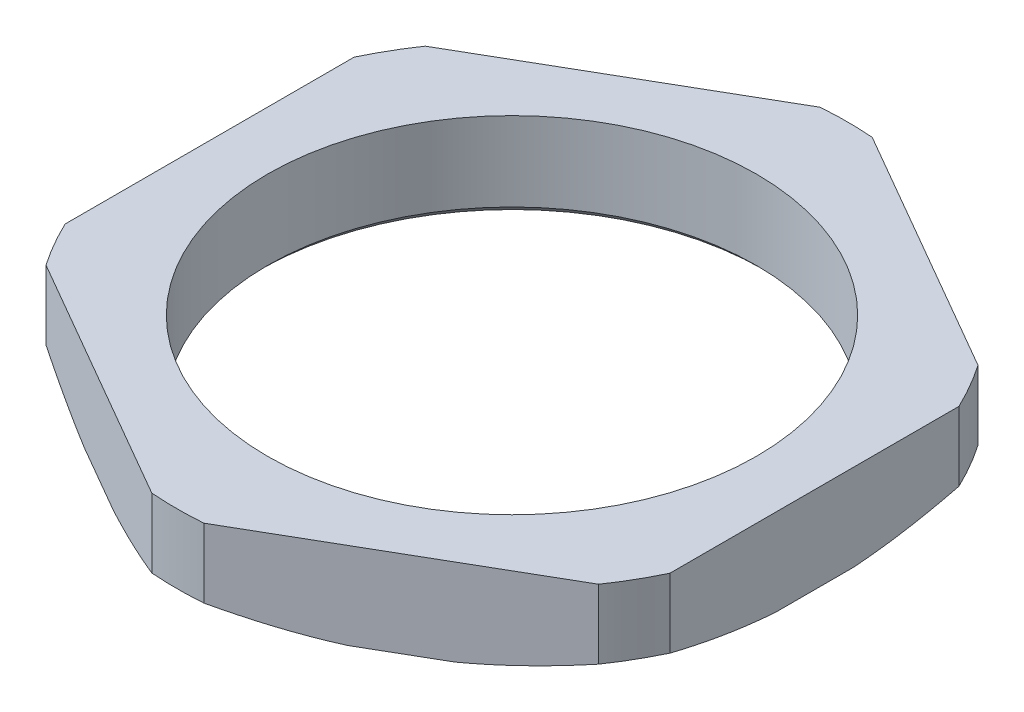
ISO-10303-21;
HEADER;
FILE_DESCRIPTION(('STEP AP214'),'2;1');
FILE_NAME('part.step','',(''),(''),'','','');
FILE_SCHEMA(('AUTOMOTIVE_DESIGN { 1 0 10303 214 1 1 1 1 }'));
ENDSEC;
DATA;
#1=APPLICATION_CONTEXT('core data for automotive mechanical design processes');
#2=APPLICATION_PROTOCOL_DEFINITION('international standard','automotive_design',2000,#1);
#3=PRODUCT_CONTEXT('',#1,'mechanical');
#4=PRODUCT('Part','Part','',(#3));
#5=PRODUCT_RELATED_PRODUCT_CATEGORY('part','',(#4));
#6=PRODUCT_DEFINITION_FORMATION('','',#4);
#7=PRODUCT_DEFINITION_CONTEXT('part definition',#1,'design');
#8=PRODUCT_DEFINITION('design','',#6,#7);
#9=PRODUCT_DEFINITION_SHAPE('','',#8);
#10=(LENGTH_UNIT() NAMED_UNIT(*) SI_UNIT(.MILLI.,.METRE.));
#11=(NAMED_UNIT(*) PLANE_ANGLE_UNIT() SI_UNIT($,.RADIAN.));
#12=(NAMED_UNIT(*) SI_UNIT($,.STERADIAN.) SOLID_ANGLE_UNIT());
#13=UNCERTAINTY_MEASURE_WITH_UNIT(LENGTH_MEASURE(1.E-05),#10,'distance_accuracy_value','');
#14=(GEOMETRIC_REPRESENTATION_CONTEXT(3) GLOBAL_UNCERTAINTY_ASSIGNED_CONTEXT((#13)) GLOBAL_UNIT_ASSIGNED_CONTEXT((#10,
#11,#12)) REPRESENTATION_CONTEXT('',''));
#15=CARTESIAN_POINT('',(0.,0.,0.));
#16=DIRECTION('',(0.,0.,1.));
#17=DIRECTION('',(1.,0.,0.));
#18=AXIS2_PLACEMENT_3D('',#15,#16,#17);
#19=CARTESIAN_POINT('',(0.,-27.1973321835051,0.));
#20=DIRECTION('',(0.,1.,0.));
#21=DIRECTION('',(0.,0.,1.));
#22=AXIS2_PLACEMENT_3D('',#19,#20,#21);
#23=CONICAL_SURFACE('',#22,50.,1.0471975511966);
#24=CARTESIAN_POINT('',(18.3610824149374,-38.6,-24.0402402765008));
#25=CARTESIAN_POINT('',(18.7382562288762,-38.5677652136786,-23.8224494033926));
#26=CARTESIAN_POINT('',(19.1150634151375,-38.5302174003489,-23.6048234457649));
#27=CARTESIAN_POINT('',(19.8688161578509,-38.4446695734121,-23.1695063900173));
#28=CARTESIAN_POINT('',(20.2457593680452,-38.396641759302,-22.9518166866672));
#29=CARTESIAN_POINT('',(21.001058094783,-38.2901413551853,-22.5157462243451));
#30=CARTESIAN_POINT('',(21.3794070228387,-38.2316033486737,-22.2973700743694));
#31=CARTESIAN_POINT('',(22.1386580231048,-38.1041345691691,-21.8591620056769));
#32=CARTESIAN_POINT('',(22.5195477934416,-38.0351057252138,-21.6393373659716));
#33=CARTESIAN_POINT('',(23.273149310614,-37.8889431103794,-21.2042687274169));
#34=CARTESIAN_POINT('',(23.6458862650549,-37.8119748480218,-20.9890126494644));
#35=CARTESIAN_POINT('',(24.3932664391002,-37.6486224093566,-20.5574335452286));
#36=CARTESIAN_POINT('',(24.7678970141932,-37.5621603823469,-20.34111812369));
#37=CARTESIAN_POINT('',(25.5199262760524,-37.3798473874207,-19.9069410339699));
#38=CARTESIAN_POINT('',(25.8973077347134,-37.2839004969652,-19.6890899081569));
#39=CARTESIAN_POINT('',(26.6556216700552,-37.0826361137301,-19.2513414411712));
#40=CARTESIAN_POINT('',(27.0365322822852,-36.9772085681087,-19.031456771969));
#41=CARTESIAN_POINT('',(27.4165967559554,-36.8679491924312,-18.8120366340634));
#42=B_SPLINE_CURVE_WITH_KNOTS('',3,(#24,#25,#26,#27,#28,#29,#30,#31,#32,#33,#34,#35,#36,#37,#38,
#39,#40,#41),.UNSPECIFIED.,.F.,.F.,(4,2,2,2,2,2,2,2,4),(0.,1.31014422115406,2.62380707882064,
3.94594918267663,5.28131229155487,6.59298565196993,7.91635666592117,9.2548364538421,
10.6115906910393),.UNSPECIFIED.);
#43=CARTESIAN_POINT('',(18.3610824149372,-38.6,-24.0402402765006));
#44=VERTEX_POINT('',#43);
#45=CARTESIAN_POINT('',(27.4165967559554,-36.8679491924312,-18.8120366340633));
#46=VERTEX_POINT('',#45);
#47=EDGE_CURVE('E548',#44,#46,#42,.T.);
#48=ORIENTED_EDGE('',*,*,#47,.T.);
#49=CARTESIAN_POINT('',(0.,-36.8679491924312,0.));
#50=DIRECTION('',(0.,-1.,0.));
#51=DIRECTION('',(0.,0.,1.));
#52=AXIS2_PLACEMENT_3D('',#49,#50,#51);
#53=CIRCLE('',#52,33.25);
#54=CARTESIAN_POINT('',(30.,-36.8679491924312,-14.3374509589397));
#55=VERTEX_POINT('',#54);
#56=EDGE_CURVE('E600',#46,#55,#53,.T.);
#57=ORIENTED_EDGE('',*,*,#56,.T.);
#58=CARTESIAN_POINT('',(30.0000000000002,-36.8679491924312,-14.3374509589397));
#59=CARTESIAN_POINT('',(29.9999914392657,-36.9763099923725,-13.9022042546082));
#60=CARTESIAN_POINT('',(29.9999632886276,-37.080901257903,-13.466008413138));
#61=CARTESIAN_POINT('',(29.9999105496554,-37.2806547432178,-12.5975925785544));
#62=CARTESIAN_POINT('',(29.9998859187907,-37.375924178509,-12.1653972226606));
#63=CARTESIAN_POINT('',(29.999880523527,-37.5570436549169,-11.3040883776325));
#64=CARTESIAN_POINT('',(29.9998992707064,-37.642987277463,-10.8749946177221));
#65=CARTESIAN_POINT('',(29.9999648804021,-37.8054636833068,-10.0189396742454));
#66=CARTESIAN_POINT('',(30.0000114939919,-37.8820726431306,-9.59199296443066));
#67=CARTESIAN_POINT('',(29.9999881066464,-38.0288749456774,-8.72172961235007));
#68=CARTESIAN_POINT('',(29.9999139976324,-38.0987528909263,-8.27835961708256));
#69=CARTESIAN_POINT('',(29.9997833705393,-38.2277496316844,-7.39458875932172));
#70=CARTESIAN_POINT('',(29.9997266837061,-38.2869691795145,-6.95420263625981));
#71=CARTESIAN_POINT('',(29.9997260897711,-38.3946628543809,-6.07501032383865));
#72=CARTESIAN_POINT('',(29.9997814544789,-38.4432041035447,-5.63621237958761));
#73=CARTESIAN_POINT('',(29.9999052572295,-38.5296110797442,-4.75875783763248));
#74=CARTESIAN_POINT('',(29.9999736597577,-38.5675051311983,-4.32010402605792));
#75=CARTESIAN_POINT('',(30.0000000000002,-38.6,-3.88104367406506));
#76=B_SPLINE_CURVE_WITH_KNOTS('',3,(#58,#59,#60,#61,#62,#63,#64,#65,#66,#67,#68,#69,#70,#71,#72,
#73,#74,#75),.UNSPECIFIED.,.F.,.F.,(4,2,2,2,2,2,2,2,4),(0.,1.34559696001121,2.67323460774911,
3.98599636940082,5.28720306594467,6.63362056276715,7.96655250730569,9.29084993119745,
10.611590270419),.UNSPECIFIED.);
#77=CARTESIAN_POINT('',(30.,-38.6,-3.88104367406497));
#78=VERTEX_POINT('',#77);
#79=EDGE_CURVE('E499',#55,#78,#76,.T.);
#80=ORIENTED_EDGE('',*,*,#79,.T.);
#81=CARTESIAN_POINT('',(0.,-38.6,0.));
#82=DIRECTION('',(0.,1.,0.));
#83=DIRECTION('',(0.,0.,1.));
#84=AXIS2_PLACEMENT_3D('',#81,#82,#83);
#85=CIRCLE('',#84,30.25);
#86=EDGE_CURVE('E625',#78,#44,#85,.T.);
#87=ORIENTED_EDGE('',*,*,#86,.T.);
#88=EDGE_LOOP('',(#48,#57,#80,#87));
#89=FACE_BOUND('',#88,.T.);
#90=ADVANCED_FACE('F16',(#89),#23,.T.);
#91=CARTESIAN_POINT('',(0.,-27.1973321835051,0.));
#92=DIRECTION('',(0.,1.,0.));
#93=DIRECTION('',(0.,0.,1.));
#94=AXIS2_PLACEMENT_3D('',#91,#92,#93);
#95=CONICAL_SURFACE('',#94,50.,1.0471975511966);
#96=CARTESIAN_POINT('',(30.0000000000002,-38.6,3.88104367406505));
#97=CARTESIAN_POINT('',(29.9999744787404,-38.5677546789575,4.31672290470706));
#98=CARTESIAN_POINT('',(29.999929138101,-38.5301811982152,4.75200071438976));
#99=CARTESIAN_POINT('',(29.9998713297949,-38.4445478022017,5.62287583021261));
#100=CARTESIAN_POINT('',(29.999858963612,-38.3964560054696,6.05847000505937));
#101=CARTESIAN_POINT('',(29.9999409481148,-38.2897932483517,6.93140181122378));
#102=CARTESIAN_POINT('',(30.0000360312159,-38.2311526865389,7.36873091344257));
#103=CARTESIAN_POINT('',(30.0002158481064,-38.1034459160671,8.24651081047185));
#104=CARTESIAN_POINT('',(30.0003004638427,-38.0342775216248,8.68694670335952));
#105=CARTESIAN_POINT('',(30.0003087195788,-37.8879763497481,9.55757407902001));
#106=CARTESIAN_POINT('',(30.0002354967638,-37.8110272329801,9.98779650191003));
#107=CARTESIAN_POINT('',(30.0001063505703,-37.6477521251498,10.8503016725928));
#108=CARTESIAN_POINT('',(30.0000505818866,-37.5613509654067,11.2825701745602));
#109=CARTESIAN_POINT('',(29.999985133864,-37.379200063208,12.1501461320308));
#110=CARTESIAN_POINT('',(29.999975973691,-37.2833570866046,12.5854339626052));
#111=CARTESIAN_POINT('',(29.9999786833342,-37.082340900894,13.4599694520768));
#112=CARTESIAN_POINT('',(29.999990835412,-36.9770602531595,13.8991924402612));
#113=CARTESIAN_POINT('',(30.0000000000002,-36.8679491924312,14.3374509589397));
#114=B_SPLINE_CURVE_WITH_KNOTS('',3,(#96,#97,#98,#99,#100,#101,#102,#103,#104,#105,#106,#107,
#108,#109,#110,#111,#112,#113),.UNSPECIFIED.,.F.,.F.,(4,2,2,2,2,2,2,2,4),(0.,1.31056980807915,
2.62516846250612,3.9487822575175,5.28617624769976,6.59723374092933,7.91960194447076,
9.25666807991518,10.6115764264598),.UNSPECIFIED.);
#115=CARTESIAN_POINT('',(30.,-38.6,3.88104367406499));
#116=VERTEX_POINT('',#115);
#117=CARTESIAN_POINT('',(30.,-36.8679491924312,14.3374509589397));
#118=VERTEX_POINT('',#117);
#119=EDGE_CURVE('E481',#116,#118,#114,.T.);
#120=ORIENTED_EDGE('',*,*,#119,.T.);
#121=CARTESIAN_POINT('',(0.,-36.8679491924312,0.));
#122=DIRECTION('',(0.,-1.,0.));
#123=DIRECTION('',(0.,0.,1.));
#124=AXIS2_PLACEMENT_3D('',#121,#122,#123);
#125=CIRCLE('',#124,33.25);
#126=CARTESIAN_POINT('',(27.4165967559554,-36.8679491924312,18.8120366340633));
#127=VERTEX_POINT('',#126);
#128=EDGE_CURVE('E457',#118,#127,#125,.T.);
#129=ORIENTED_EDGE('',*,*,#128,.T.);
#130=CARTESIAN_POINT('',(27.4165967559555,-36.8679491924312,18.8120366340634));
#131=CARTESIAN_POINT('',(27.0383482665984,-36.9766864709008,19.0304085030129));
#132=CARTESIAN_POINT('',(26.6592620549629,-37.0816281079389,19.2492409950178));
#133=CARTESIAN_POINT('',(25.9045591663223,-37.2820151372434,19.6849070175574));
#134=CARTESIAN_POINT('',(25.5289640267898,-37.3775688964056,19.9017280634287));
#135=CARTESIAN_POINT('',(24.7804810225922,-37.5591899112042,20.3338586573571));
#136=CARTESIAN_POINT('',(24.4076101556957,-37.6453516920728,20.5491578162153));
#137=CARTESIAN_POINT('',(23.6637361197738,-37.8081976685842,20.9787104162921));
#138=CARTESIAN_POINT('',(23.2927454556591,-37.8849587055932,21.1929563487643));
#139=CARTESIAN_POINT('',(22.5390970058769,-38.0314930389369,21.6280490097448));
#140=CARTESIAN_POINT('',(22.1564006713828,-38.1010139110195,21.8489142075423));
#141=CARTESIAN_POINT('',(21.3935651354844,-38.2293681984724,22.2891884778093));
#142=CARTESIAN_POINT('',(21.0134384472083,-38.2883011975278,22.5085901325985));
#143=CARTESIAN_POINT('',(20.2545975267378,-38.3954933966182,22.9467065095127));
#144=CARTESIAN_POINT('',(19.8758899871506,-38.4438189588779,23.1654165416162));
#145=CARTESIAN_POINT('',(19.1186043365549,-38.5298652813936,23.6027767746389));
#146=CARTESIAN_POINT('',(18.7400285967131,-38.5676141045691,23.8214255662098));
#147=CARTESIAN_POINT('',(18.3610824149373,-38.6,24.0402402765008));
#148=B_SPLINE_CURVE_WITH_KNOTS('',3,(#130,#131,#132,#133,#134,#135,#136,#137,#138,#139,#140,
#141,#142,#143,#144,#145,#146,#147),.UNSPECIFIED.,.F.,.F.,(4,2,2,2,2,2,2,2,4),(0.,
1.35027160813138,2.68245754851246,3.99967535253032,5.30528327405131,6.64705256933095,
7.97545305395357,9.29528964585662,10.6115904606512),.UNSPECIFIED.);
#149=CARTESIAN_POINT('',(18.3610824149372,-38.6,24.0402402765006));
#150=VERTEX_POINT('',#149);
#151=EDGE_CURVE('E443',#127,#150,#148,.T.);
#152=ORIENTED_EDGE('',*,*,#151,.T.);
#153=CARTESIAN_POINT('',(0.,-38.6,0.));
#154=DIRECTION('',(0.,1.,0.));
#155=DIRECTION('',(0.,0.,1.));
#156=AXIS2_PLACEMENT_3D('',#153,#154,#155);
#157=CIRCLE('',#156,30.25);
#158=EDGE_CURVE('E194',#150,#116,#157,.T.);
#159=ORIENTED_EDGE('',*,*,#158,.T.);
#160=EDGE_LOOP('',(#120,#129,#152,#159));
#161=FACE_BOUND('',#160,.T.);
#162=ADVANCED_FACE('F18',(#161),#95,.T.);
#163=CARTESIAN_POINT('',(0.,-27.1973321835051,0.));
#164=DIRECTION('',(0.,1.,0.));
#165=DIRECTION('',(0.,0.,1.));
#166=AXIS2_PLACEMENT_3D('',#163,#164,#165);
#167=CONICAL_SURFACE('',#166,50.,1.0471975511966);
#168=CARTESIAN_POINT('',(2.58340324404467,-36.8679491924312,-33.1494875930032));
#169=CARTESIAN_POINT('',(2.96164307468822,-36.9766864708958,-32.9311007267616));
#170=CARTESIAN_POINT('',(3.34070067773902,-37.0816281079288,-32.7122186832742));
#171=CARTESIAN_POINT('',(4.09534996512315,-37.2820151372267,-32.2764598206871));
#172=CARTESIAN_POINT('',(4.4709200686845,-37.377568896387,-32.0595954112541));
#173=CARTESIAN_POINT('',(5.21939764287954,-37.5591899111854,-31.6274554122841));
#174=CARTESIAN_POINT('',(5.59228761731878,-37.6453516920555,-31.4121893486469));
#175=CARTESIAN_POINT('',(6.33622809922916,-37.8081976685739,-30.9827518363463));
#176=CARTESIAN_POINT('',(6.70726585147986,-37.8849587055882,-30.7685874628799));
#177=CARTESIAN_POINT('',(7.46089137377672,-38.0314930389353,-30.3334550903307));
#178=CARTESIAN_POINT('',(7.8435144131096,-38.1010139110169,-30.1124629416293));
#179=CARTESIAN_POINT('',(8.60622088371883,-38.2293681984682,-29.6719651237763));
#180=CARTESIAN_POINT('',(8.9862916345316,-38.2883011975229,-29.4524665824712));
#181=CARTESIAN_POINT('',(9.74513200698996,-38.3954933966132,-29.0143492563717));
#182=CARTESIAN_POINT('',(10.1238942206543,-38.4438189588733,-28.7957339225343));
#183=CARTESIAN_POINT('',(10.8813021183788,-38.5298652813909,-28.3585854276977));
#184=CARTESIAN_POINT('',(11.2599453963243,-38.5676141045677,-28.1400536155149));
#185=CARTESIAN_POINT('',(11.6389175850628,-38.6,-27.9212839505659));
#186=B_SPLINE_CURVE_WITH_KNOTS('',3,(#168,#169,#170,#171,#172,#173,#174,#175,#176,#177,#178,
#179,#180,#181,#182,#183,#184,#185),.UNSPECIFIED.,.F.,.F.,(4,2,2,2,2,2,2,2,4),(0.,1.35027160807,
2.68245754843179,3.99967535247068,5.3052832740511,6.64705256927181,7.97545305387517,
9.29528964579812,10.6115904606512),.UNSPECIFIED.);
#187=CARTESIAN_POINT('',(2.58340324404467,-36.8679491924312,-33.149487593003));
#188=VERTEX_POINT('',#187);
#189=CARTESIAN_POINT('',(11.6389175850628,-38.6,-27.9212839505657));
#190=VERTEX_POINT('',#189);
#191=EDGE_CURVE('E579',#188,#190,#186,.T.);
#192=ORIENTED_EDGE('',*,*,#191,.T.);
#193=CARTESIAN_POINT('',(0.,-38.6,0.));
#194=DIRECTION('',(0.,1.,0.));
#195=DIRECTION('',(0.,0.,1.));
#196=AXIS2_PLACEMENT_3D('',#193,#194,#195);
#197=CIRCLE('',#196,30.25);
#198=CARTESIAN_POINT('',(-11.6389175850627,-38.6,-27.9212839505657));
#199=VERTEX_POINT('',#198);
#200=EDGE_CURVE('E387',#190,#199,#197,.T.);
#201=ORIENTED_EDGE('',*,*,#200,.T.);
#202=CARTESIAN_POINT('',(-11.6389175850629,-38.6,-27.9212839505658));
#203=CARTESIAN_POINT('',(-11.2617182492014,-38.5677652136731,-28.1390306185639));
#204=CARTESIAN_POINT('',(-10.8848450481721,-38.530217400338,-28.3565422354163));
#205=CARTESIAN_POINT('',(-10.1309730477408,-38.4446695733933,-28.7916527309476));
#206=CARTESIAN_POINT('',(-9.75397662937374,-38.3966417592818,-29.0092502750925));
#207=CARTESIAN_POINT('',(-8.99867916778812,-38.2901413551656,-29.4453229287243));
#208=CARTESIAN_POINT('',(-8.62038541032125,-38.2316033486571,-29.6637946369116));
#209=CARTESIAN_POINT('',(-7.8612605906531,-38.1041345691587,-30.1022212566002));
#210=CARTESIAN_POINT('',(-7.4804419831974,-38.0351057252076,-30.3221691538724));
#211=CARTESIAN_POINT('',(-6.72686073124735,-37.8889431103593,-30.7572728928183));
#212=CARTESIAN_POINT('',(-6.35407502214056,-37.8119748479802,-30.9724445253667));
#213=CARTESIAN_POINT('',(-5.60662646702151,-37.6486224092867,-31.4039051903175));
#214=CARTESIAN_POINT('',(-5.23197652916667,-37.5621603822715,-31.6201870746242));
#215=CARTESIAN_POINT('',(-4.47995350879117,-37.3798473873459,-32.0543749749163));
#216=CARTESIAN_POINT('',(-4.1025981702819,-37.2839004968976,-32.2722713421093));
#217=CARTESIAN_POINT('',(-3.34433990981887,-37.0826361136894,-32.7101162406043));
#218=CARTESIAN_POINT('',(-2.96345889433886,-36.9772085680886,-32.9300521727218));
#219=CARTESIAN_POINT('',(-2.58340324404461,-36.8679491924312,-33.1494875930032));
#220=B_SPLINE_CURVE_WITH_KNOTS('',3,(#202,#203,#204,#205,#206,#207,#208,#209,#210,#211,#212,
#213,#214,#215,#216,#217,#218,#219),.UNSPECIFIED.,.F.,.F.,(4,2,2,2,2,2,2,2,4),(0.,
1.31014422138985,2.62380707913662,3.94594918291495,5.28131229155577,6.59298565221003,
7.91635666624604,9.25483645408938,10.6115906910397),.UNSPECIFIED.);
#221=CARTESIAN_POINT('',(-2.5834032440446,-36.8679491924312,-33.149487593003));
#222=VERTEX_POINT('',#221);
#223=EDGE_CURVE('E371',#199,#222,#220,.T.);
#224=ORIENTED_EDGE('',*,*,#223,.T.);
#225=CARTESIAN_POINT('',(0.,-36.8679491924312,0.));
#226=DIRECTION('',(0.,-1.,0.));
#227=DIRECTION('',(0.,0.,1.));
#228=AXIS2_PLACEMENT_3D('',#225,#226,#227);
#229=CIRCLE('',#228,33.25);
#230=EDGE_CURVE('E407',#222,#188,#229,.T.);
#231=ORIENTED_EDGE('',*,*,#230,.T.);
#232=EDGE_LOOP('',(#192,#201,#224,#231));
#233=FACE_BOUND('',#232,.T.);
#234=ADVANCED_FACE('F346',(#233),#167,.T.);
#235=CARTESIAN_POINT('',(0.,-27.1973321835051,0.));
#236=DIRECTION('',(0.,1.,0.));
#237=DIRECTION('',(0.,0.,1.));
#238=AXIS2_PLACEMENT_3D('',#235,#236,#237);
#239=CONICAL_SURFACE('',#238,50.,1.0471975511966);
#240=CARTESIAN_POINT('',(-27.4165967559554,-36.8679491924312,-18.8120366340635));
#241=CARTESIAN_POINT('',(-27.0383482665467,-36.9766864709157,-19.0304085030426));
#242=CARTESIAN_POINT('',(-26.6592620548581,-37.0816281079693,-19.2492409950743));
#243=CARTESIAN_POINT('',(-25.9045591661456,-37.2820151372939,-19.6849070176459));
#244=CARTESIAN_POINT('',(-25.5289640265946,-37.3775688964613,-19.9017280635223));
#245=CARTESIAN_POINT('',(-24.780481022395,-37.5591899112604,-20.3338586574436));
#246=CARTESIAN_POINT('',(-24.4076101555152,-37.6453516921249,-20.5491578162894));
#247=CARTESIAN_POINT('',(-23.6637361196645,-37.8081976686153,-20.9787104163335));
#248=CARTESIAN_POINT('',(-23.2927454556043,-37.8849587056082,-21.192956348785));
#249=CARTESIAN_POINT('',(-22.5390970058306,-38.0314930389414,-21.6280490097828));
#250=CARTESIAN_POINT('',(-22.1564006712901,-38.1010139110272,-21.8489142076183));
#251=CARTESIAN_POINT('',(-21.3935651353274,-38.2293681984847,-22.2891884779307));
#252=CARTESIAN_POINT('',(-21.0134384470334,-38.2883011975424,-22.5085901327273));
#253=CARTESIAN_POINT('',(-20.2545975265598,-38.3954933966332,-22.9467065096347));
#254=CARTESIAN_POINT('',(-19.8758899869874,-38.4438189588919,-23.165416541724));
#255=CARTESIAN_POINT('',(-19.1186043364554,-38.5298652814017,-23.6027767747004));
#256=CARTESIAN_POINT('',(-18.7400285966626,-38.5676141045733,-23.8214255662392));
#257=CARTESIAN_POINT('',(-18.3610824149373,-38.6,-24.0402402765008));
#258=B_SPLINE_CURVE_WITH_KNOTS('',3,(#240,#241,#242,#243,#244,#245,#246,#247,#248,#249,#250,
#251,#252,#253,#254,#255,#256,#257),.UNSPECIFIED.,.F.,.F.,(4,2,2,2,2,2,2,2,4),(0.,
1.3502716083156,2.68245754875456,3.99967535270921,5.3052832740518,6.64705256950837,
7.97545305418889,9.29528964603218,10.611590460651),.UNSPECIFIED.);
#259=CARTESIAN_POINT('',(-27.4165967559554,-36.8679491924312,-18.8120366340633));
#260=VERTEX_POINT('',#259);
#261=CARTESIAN_POINT('',(-18.3610824149372,-38.6,-24.0402402765006));
#262=VERTEX_POINT('',#261);
#263=EDGE_CURVE('E417',#260,#262,#258,.T.);
#264=ORIENTED_EDGE('',*,*,#263,.T.);
#265=CARTESIAN_POINT('',(0.,-38.6,0.));
#266=DIRECTION('',(0.,1.,0.));
#267=DIRECTION('',(0.,0.,1.));
#268=AXIS2_PLACEMENT_3D('',#265,#266,#267);
#269=CIRCLE('',#268,30.25);
#270=CARTESIAN_POINT('',(-30.,-38.6,-3.88104367406497));
#271=VERTEX_POINT('',#270);
#272=EDGE_CURVE('E333',#262,#271,#269,.T.);
#273=ORIENTED_EDGE('',*,*,#272,.T.);
#274=CARTESIAN_POINT('',(-30.0000000000002,-38.6,-3.88104367406496));
#275=CARTESIAN_POINT('',(-29.9999744787408,-38.5677546789631,-4.31672290462882));
#276=CARTESIAN_POINT('',(-29.9999291381057,-38.530181198226,-4.75200071423328));
#277=CARTESIAN_POINT('',(-29.9998713298105,-38.4445478022204,-5.62287582995135));
#278=CARTESIAN_POINT('',(-29.9998589636342,-38.3964560054897,-6.05847000477145));
#279=CARTESIAN_POINT('',(-29.999940948147,-38.2897932483714,-6.93140181093494));
#280=CARTESIAN_POINT('',(-30.0000360312513,-38.2311526865555,-7.36873091317934));
#281=CARTESIAN_POINT('',(-30.0002158481323,-38.1034459160775,-8.2465108103136));
#282=CARTESIAN_POINT('',(-30.0003004638557,-38.0342775216309,-8.68694670328047));
#283=CARTESIAN_POINT('',(-30.000308719566,-37.8879763497681,-9.55757407894269));
#284=CARTESIAN_POINT('',(-30.0002354967384,-37.8110272330217,-9.98779650175579));
#285=CARTESIAN_POINT('',(-30.0001063505352,-37.6477521252195,-10.8503016723343));
#286=CARTESIAN_POINT('',(-30.0000505818547,-37.5613509654819,-11.2825701742741));
#287=CARTESIAN_POINT('',(-29.9999851338417,-37.3792000632826,-12.1501461317422));
#288=CARTESIAN_POINT('',(-29.9999759736753,-37.283357086672,-12.5854339623414));
#289=CARTESIAN_POINT('',(-29.9999786833294,-37.0823409009346,-13.4599694519176));
#290=CARTESIAN_POINT('',(-29.9999908354116,-36.9770602531794,-13.8991924401816));
#291=CARTESIAN_POINT('',(-30.0000000000002,-36.8679491924312,-14.3374509589397));
#292=B_SPLINE_CURVE_WITH_KNOTS('',3,(#274,#275,#276,#277,#278,#279,#280,#281,#282,#283,#284,
#285,#286,#287,#288,#289,#290,#291),.UNSPECIFIED.,.F.,.F.,(4,2,2,2,2,2,2,2,4),(0.,
1.31056980784402,2.62516846219101,3.94878225727988,5.28617624769895,6.59723374068991,
7.91960194414683,9.25666807966868,10.6115764264597),.UNSPECIFIED.);
#293=CARTESIAN_POINT('',(-30.,-36.8679491924312,-14.3374509589397));
#294=VERTEX_POINT('',#293);
#295=EDGE_CURVE('E311',#271,#294,#292,.T.);
#296=ORIENTED_EDGE('',*,*,#295,.T.);
#297=CARTESIAN_POINT('',(0.,-36.8679491924312,0.));
#298=DIRECTION('',(0.,-1.,0.));
#299=DIRECTION('',(0.,0.,1.));
#300=AXIS2_PLACEMENT_3D('',#297,#298,#299);
#301=CIRCLE('',#300,33.25);
#302=EDGE_CURVE('E1114',#294,#260,#301,.T.);
#303=ORIENTED_EDGE('',*,*,#302,.T.);
#304=EDGE_LOOP('',(#264,#273,#296,#303));
#305=FACE_BOUND('',#304,.T.);
#306=ADVANCED_FACE('F245',(#305),#239,.T.);
#307=CARTESIAN_POINT('',(0.,-27.1973321835051,0.));
#308=DIRECTION('',(0.,1.,0.));
#309=DIRECTION('',(0.,0.,1.));
#310=AXIS2_PLACEMENT_3D('',#307,#308,#309);
#311=CONICAL_SURFACE('',#310,50.,1.0471975511966);
#312=CARTESIAN_POINT('',(-30.0000000000002,-36.8679491924312,14.3374509589396));
#313=CARTESIAN_POINT('',(-29.9999914392657,-36.9763099923725,13.9022042546081));
#314=CARTESIAN_POINT('',(-29.9999632886277,-37.080901257903,13.4660084131379));
#315=CARTESIAN_POINT('',(-29.9999105496553,-37.2806547432178,12.5975925785544));
#316=CARTESIAN_POINT('',(-29.9998859187907,-37.375924178509,12.1653972226606));
#317=CARTESIAN_POINT('',(-29.999880523527,-37.5570436549169,11.3040883776325));
#318=CARTESIAN_POINT('',(-29.9998992707064,-37.642987277463,10.8749946177221));
#319=CARTESIAN_POINT('',(-29.9999648804021,-37.8054636833068,10.0189396742454));
#320=CARTESIAN_POINT('',(-30.0000114939919,-37.8820726431306,9.5919929644306));
#321=CARTESIAN_POINT('',(-29.9999881066464,-38.0288749456774,8.72172961234999));
#322=CARTESIAN_POINT('',(-29.9999139976324,-38.0987528909263,8.27835961708251));
#323=CARTESIAN_POINT('',(-29.9997833705393,-38.2277496316844,7.3945887593217));
#324=CARTESIAN_POINT('',(-29.9997266837061,-38.2869691795145,6.95420263625979));
#325=CARTESIAN_POINT('',(-29.9997260897711,-38.3946628543809,6.07501032383863));
#326=CARTESIAN_POINT('',(-29.9997814544789,-38.4432041035447,5.63621237958757));
#327=CARTESIAN_POINT('',(-29.9999052572296,-38.5296110797442,4.75875783763241));
#328=CARTESIAN_POINT('',(-29.9999736597577,-38.5675051311983,4.32010402605784));
#329=CARTESIAN_POINT('',(-30.0000000000002,-38.6,3.88104367406497));
#330=B_SPLINE_CURVE_WITH_KNOTS('',3,(#312,#313,#314,#315,#316,#317,#318,#319,#320,#321,#322,
#323,#324,#325,#326,#327,#328,#329),.UNSPECIFIED.,.F.,.F.,(4,2,2,2,2,2,2,2,4),(0.,
1.34559696001112,2.67323460774897,3.98599636940072,5.28720306594465,6.63362056276707,
7.96655250730559,9.2908499311974,10.6115902704189),.UNSPECIFIED.);
#331=CARTESIAN_POINT('',(-30.,-36.8679491924312,14.3374509589397));
#332=VERTEX_POINT('',#331);
#333=CARTESIAN_POINT('',(-30.,-38.6,3.88104367406498));
#334=VERTEX_POINT('',#333);
#335=EDGE_CURVE('E364',#332,#334,#330,.T.);
#336=ORIENTED_EDGE('',*,*,#335,.T.);
#337=CARTESIAN_POINT('',(0.,-38.6,0.));
#338=DIRECTION('',(0.,1.,0.));
#339=DIRECTION('',(0.,0.,1.));
#340=AXIS2_PLACEMENT_3D('',#337,#338,#339);
#341=CIRCLE('',#340,30.25);
#342=CARTESIAN_POINT('',(-18.3610824149372,-38.6,24.0402402765006));
#343=VERTEX_POINT('',#342);
#344=EDGE_CURVE('E291',#334,#343,#341,.T.);
#345=ORIENTED_EDGE('',*,*,#344,.T.);
#346=CARTESIAN_POINT('',(-18.3610824149374,-38.6,24.0402402765007));
#347=CARTESIAN_POINT('',(-18.7382562289439,-38.5677652136731,23.8224494033531));
#348=CARTESIAN_POINT('',(-19.1150634152709,-38.530217400338,23.6048234456824));
#349=CARTESIAN_POINT('',(-19.8688161580698,-38.4446695733933,23.1695063898728));
#350=CARTESIAN_POINT('',(-20.2457593682839,-38.3966417592818,22.9518166865036));
#351=CARTESIAN_POINT('',(-21.0010580950175,-38.2901413551657,22.5157462241725));
#352=CARTESIAN_POINT('',(-21.3794070230493,-38.2316033486571,22.2973700742068));
#353=CARTESIAN_POINT('',(-22.1386580232291,-38.1041345691587,21.8591620055752));
#354=CARTESIAN_POINT('',(-22.5195477935036,-38.0351057252076,21.6393373659209));
#355=CARTESIAN_POINT('',(-23.2731493106874,-37.8889431103593,21.2042687273894));
#356=CARTESIAN_POINT('',(-23.6458862652015,-37.8119748479802,20.9890126494092));
#357=CARTESIAN_POINT('',(-24.3932664393422,-37.6486224092867,20.5574335451295));
#358=CARTESIAN_POINT('',(-24.7678970144577,-37.5621603822715,20.3411181235743));
#359=CARTESIAN_POINT('',(-25.5199262763142,-37.3798473873459,19.9069410338444));
#360=CARTESIAN_POINT('',(-25.8973077349504,-37.2839004968976,19.6890899080382));
#361=CARTESIAN_POINT('',(-26.6556216701959,-37.0826361136894,19.2513414410953));
#362=CARTESIAN_POINT('',(-27.0365322823546,-36.9772085680887,19.0314567719292));
#363=CARTESIAN_POINT('',(-27.4165967559555,-36.8679491924312,18.8120366340633));
#364=B_SPLINE_CURVE_WITH_KNOTS('',3,(#346,#347,#348,#349,#350,#351,#352,#353,#354,#355,#356,
#357,#358,#359,#360,#361,#362,#363),.UNSPECIFIED.,.F.,.F.,(4,2,2,2,2,2,2,2,4),(0.,
1.31014422138971,2.62380707913637,3.94594918291466,5.28131229155545,6.59298565220992,
7.91635666624601,9.25483645408938,10.6115906910395),.UNSPECIFIED.);
#365=CARTESIAN_POINT('',(-27.4165967559554,-36.8679491924312,18.8120366340633));
#366=VERTEX_POINT('',#365);
#367=EDGE_CURVE('E28',#343,#366,#364,.T.);
#368=ORIENTED_EDGE('',*,*,#367,.T.);
#369=CARTESIAN_POINT('',(0.,-36.8679491924312,0.));
#370=DIRECTION('',(0.,-1.,0.));
#371=DIRECTION('',(0.,0.,1.));
#372=AXIS2_PLACEMENT_3D('',#369,#370,#371);
#373=CIRCLE('',#372,33.25);
#374=EDGE_CURVE('E11',#366,#332,#373,.T.);
#375=ORIENTED_EDGE('',*,*,#374,.T.);
#376=EDGE_LOOP('',(#336,#345,#368,#375));
#377=FACE_BOUND('',#376,.T.);
#378=ADVANCED_FACE('F470',(#377),#311,.T.);
#379=CARTESIAN_POINT('',(0.,-38.6,0.));
#380=DIRECTION('',(0.,1.,0.));
#381=DIRECTION('',(0.,0.,-1.));
#382=AXIS2_PLACEMENT_3D('',#379,#380,#381);
#383=CYLINDRICAL_SURFACE('',#382,33.25);
#384=ORIENTED_EDGE('',*,*,#374,.F.);
#385=DIRECTION('',(0.,1.,0.));
#386=VECTOR('',#385,1.);
#387=CARTESIAN_POINT('',(-27.4165967559554,-38.6,18.8120366340633));
#388=LINE('',#387,#386);
#389=CARTESIAN_POINT('',(-27.4165967559554,-30.,18.8120366340633));
#390=VERTEX_POINT('',#389);
#391=EDGE_CURVE('E308',#366,#390,#388,.T.);
#392=ORIENTED_EDGE('',*,*,#391,.T.);
#393=CARTESIAN_POINT('',(0.,-30.,0.));
#394=DIRECTION('',(0.,-1.,0.));
#395=DIRECTION('',(0.,0.,-1.));
#396=AXIS2_PLACEMENT_3D('',#393,#394,#395);
#397=CIRCLE('',#396,33.25);
#398=CARTESIAN_POINT('',(-30.,-30.,14.3374509589397));
#399=VERTEX_POINT('',#398);
#400=EDGE_CURVE('E1147',#390,#399,#397,.T.);
#401=ORIENTED_EDGE('',*,*,#400,.T.);
#402=DIRECTION('',(0.,1.,0.));
#403=VECTOR('',#402,1.);
#404=CARTESIAN_POINT('',(-30.,-38.6,14.3374509589397));
#405=LINE('',#404,#403);
#406=EDGE_CURVE('E356',#332,#399,#405,.T.);
#407=ORIENTED_EDGE('',*,*,#406,.F.);
#408=EDGE_LOOP('',(#384,#392,#401,#407));
#409=FACE_BOUND('',#408,.T.);
#410=ADVANCED_FACE('F278',(#409),#383,.T.);
#411=CARTESIAN_POINT('',(-27.4165967559554,-38.6,18.8120366340633));
#412=DIRECTION('',(0.5,0.,-0.866025403784438));
#413=DIRECTION('',(0.,1.,0.));
#414=AXIS2_PLACEMENT_3D('',#411,#412,#413);
#415=PLANE('',#414);
#416=CARTESIAN_POINT('',(-2.58340324404479,-36.8679491924312,33.1494875930031));
#417=CARTESIAN_POINT('',(-2.96164307475692,-36.9766864709157,32.9311007267216));
#418=CARTESIAN_POINT('',(-3.3407006778742,-37.0816281079693,32.7122186831908));
#419=CARTESIAN_POINT('',(-4.09534996534316,-37.2820151372939,32.2764598205421));
#420=CARTESIAN_POINT('',(-4.47092006892269,-37.3775688964613,32.0595954110912));
#421=CARTESIAN_POINT('',(-5.21939764311075,-37.5591899112604,31.6274554121141));
#422=CARTESIAN_POINT('',(-5.59228761752461,-37.6453516921249,31.4121893484879));
#423=CARTESIAN_POINT('',(-6.33622809934977,-37.8081976686153,30.9827518362475));
#424=CARTESIAN_POINT('',(-6.70726585154036,-37.8849587056082,30.7685874628304));
#425=CARTESIAN_POINT('',(-7.46089137385148,-38.0314930389414,30.3334550903025));
#426=CARTESIAN_POINT('',(-7.84351441325919,-38.1010139110272,30.112462941573));
#427=CARTESIAN_POINT('',(-8.60622088396375,-38.2293681984847,29.6719651236759));
#428=CARTESIAN_POINT('',(-8.98629163479696,-38.2883011975424,29.4524665823552));
#429=CARTESIAN_POINT('',(-9.74513200724958,-38.3954933966332,29.0143492562476));
#430=CARTESIAN_POINT('',(-10.1238942208876,-38.4438189588919,28.7957339224178));
#431=CARTESIAN_POINT('',(-10.8813021185162,-38.5298652814017,28.3585854276239));
#432=CARTESIAN_POINT('',(-11.259945396392,-38.5676141045733,28.1400536154762));
#433=CARTESIAN_POINT('',(-11.6389175850629,-38.6,27.9212839505658));
#434=B_SPLINE_CURVE_WITH_KNOTS('',3,(#416,#417,#418,#419,#420,#421,#422,#423,#424,#425,#426,
#427,#428,#429,#430,#431,#432,#433),.UNSPECIFIED.,.F.,.F.,(4,2,2,2,2,2,2,2,4),(0.,
1.3502716083156,2.68245754875453,3.99967535270921,5.30528327405178,6.64705256950842,
7.97545305418896,9.29528964603221,10.611590460651),.UNSPECIFIED.);
#435=CARTESIAN_POINT('',(-2.58340324404467,-36.8679491924312,33.149487593003));
#436=VERTEX_POINT('',#435);
#437=CARTESIAN_POINT('',(-11.6389175850628,-38.6,27.9212839505657));
#438=VERTEX_POINT('',#437);
#439=EDGE_CURVE('E217',#436,#438,#434,.T.);
#440=ORIENTED_EDGE('',*,*,#439,.F.);
#441=DIRECTION('',(0.,1.,0.));
#442=VECTOR('',#441,1.);
#443=CARTESIAN_POINT('',(-2.58340324404467,-38.6,33.149487593003));
#444=LINE('',#443,#442);
#445=CARTESIAN_POINT('',(-2.58340324404467,-30.,33.149487593003));
#446=VERTEX_POINT('',#445);
#447=EDGE_CURVE('E265',#436,#446,#444,.T.);
#448=ORIENTED_EDGE('',*,*,#447,.T.);
#449=DIRECTION('',(-0.866025403784438,0.,-0.5));
#450=VECTOR('',#449,1.);
#451=CARTESIAN_POINT('',(-27.4165967559554,-30.,18.8120366340633));
#452=LINE('',#451,#450);
#453=EDGE_CURVE('E1142',#446,#390,#452,.T.);
#454=ORIENTED_EDGE('',*,*,#453,.T.);
#455=ORIENTED_EDGE('',*,*,#391,.F.);
#456=ORIENTED_EDGE('',*,*,#367,.F.);
#457=DIRECTION('',(-0.866025403784438,0.,-0.5));
#458=VECTOR('',#457,1.);
#459=CARTESIAN_POINT('',(-27.4165967559554,-38.6,18.8120366340633));
#460=LINE('',#459,#458);
#461=EDGE_CURVE('E198',#438,#343,#460,.T.);
#462=ORIENTED_EDGE('',*,*,#461,.F.);
#463=EDGE_LOOP('',(#440,#448,#454,#455,#456,#462));
#464=FACE_BOUND('',#463,.T.);
#465=ADVANCED_FACE('F267',(#464),#415,.F.);
#466=CARTESIAN_POINT('',(-30.,-38.6,-14.3374509589397));
#467=DIRECTION('',(1.,0.,0.));
#468=DIRECTION('',(0.,0.,-1.));
#469=AXIS2_PLACEMENT_3D('',#466,#467,#468);
#470=PLANE('',#469);
#471=ORIENTED_EDGE('',*,*,#335,.F.);
#472=ORIENTED_EDGE('',*,*,#406,.T.);
#473=DIRECTION('',(0.,0.,1.));
#474=VECTOR('',#473,1.);
#475=CARTESIAN_POINT('',(-30.,-30.,-14.3374509589397));
#476=LINE('',#475,#474);
#477=CARTESIAN_POINT('',(-30.,-30.,-14.3374509589397));
#478=VERTEX_POINT('',#477);
#479=EDGE_CURVE('E1176',#478,#399,#476,.T.);
#480=ORIENTED_EDGE('',*,*,#479,.F.);
#481=DIRECTION('',(0.,1.,0.));
#482=VECTOR('',#481,1.);
#483=CARTESIAN_POINT('',(-30.,-38.6,-14.3374509589397));
#484=LINE('',#483,#482);
#485=EDGE_CURVE('E1111',#294,#478,#484,.T.);
#486=ORIENTED_EDGE('',*,*,#485,.F.);
#487=ORIENTED_EDGE('',*,*,#295,.F.);
#488=DIRECTION('',(0.,0.,1.));
#489=VECTOR('',#488,1.);
#490=CARTESIAN_POINT('',(-30.,-38.6,-14.3374509589397));
#491=LINE('',#490,#489);
#492=EDGE_CURVE('E299',#271,#334,#491,.T.);
#493=ORIENTED_EDGE('',*,*,#492,.T.);
#494=EDGE_LOOP('',(#471,#472,#480,#486,#487,#493));
#495=FACE_BOUND('',#494,.T.);
#496=ADVANCED_FACE('F277',(#495),#470,.F.);
#497=CARTESIAN_POINT('',(0.,-38.6,0.));
#498=DIRECTION('',(0.,1.,0.));
#499=DIRECTION('',(0.,0.,1.));
#500=AXIS2_PLACEMENT_3D('',#497,#498,#499);
#501=CYLINDRICAL_SURFACE('',#500,33.25);
#502=ORIENTED_EDGE('',*,*,#302,.F.);
#503=ORIENTED_EDGE('',*,*,#485,.T.);
#504=CARTESIAN_POINT('',(0.,-30.,0.));
#505=DIRECTION('',(0.,1.,0.));
#506=DIRECTION('',(0.,0.,1.));
#507=AXIS2_PLACEMENT_3D('',#504,#505,#506);
#508=CIRCLE('',#507,33.25);
#509=CARTESIAN_POINT('',(-27.4165967559554,-30.,-18.8120366340633));
#510=VERTEX_POINT('',#509);
#511=EDGE_CURVE('E1125',#510,#478,#508,.T.);
#512=ORIENTED_EDGE('',*,*,#511,.F.);
#513=DIRECTION('',(0.,1.,0.));
#514=VECTOR('',#513,1.);
#515=CARTESIAN_POINT('',(-27.4165967559554,-38.6,-18.8120366340633));
#516=LINE('',#515,#514);
#517=EDGE_CURVE('E431',#260,#510,#516,.T.);
#518=ORIENTED_EDGE('',*,*,#517,.F.);
#519=EDGE_LOOP('',(#502,#503,#512,#518));
#520=FACE_BOUND('',#519,.T.);
#521=ADVANCED_FACE('F343',(#520),#501,.T.);
#522=CARTESIAN_POINT('',(-27.4165967559554,-38.6,-18.8120366340633));
#523=DIRECTION('',(0.5,0.,0.866025403784439));
#524=DIRECTION('',(0.,-1.,0.));
#525=AXIS2_PLACEMENT_3D('',#522,#523,#524);
#526=PLANE('',#525);
#527=ORIENTED_EDGE('',*,*,#263,.F.);
#528=ORIENTED_EDGE('',*,*,#517,.T.);
#529=DIRECTION('',(-0.866025403784439,0.,0.5));
#530=VECTOR('',#529,1.);
#531=CARTESIAN_POINT('',(-27.4165967559554,-30.,-18.8120366340633));
#532=LINE('',#531,#530);
#533=CARTESIAN_POINT('',(-2.58340324404466,-30.,-33.149487593003));
#534=VERTEX_POINT('',#533);
#535=EDGE_CURVE('E1121',#534,#510,#532,.T.);
#536=ORIENTED_EDGE('',*,*,#535,.F.);
#537=DIRECTION('',(0.,1.,0.));
#538=VECTOR('',#537,1.);
#539=CARTESIAN_POINT('',(-2.58340324404466,-38.6,-33.149487593003));
#540=LINE('',#539,#538);
#541=EDGE_CURVE('E403',#222,#534,#540,.T.);
#542=ORIENTED_EDGE('',*,*,#541,.F.);
#543=ORIENTED_EDGE('',*,*,#223,.F.);
#544=DIRECTION('',(-0.866025403784439,0.,0.5));
#545=VECTOR('',#544,1.);
#546=CARTESIAN_POINT('',(-27.4165967559554,-38.6,-18.8120366340633));
#547=LINE('',#546,#545);
#548=EDGE_CURVE('E396',#199,#262,#547,.T.);
#549=ORIENTED_EDGE('',*,*,#548,.T.);
#550=EDGE_LOOP('',(#527,#528,#536,#542,#543,#549));
#551=FACE_BOUND('',#550,.T.);
#552=ADVANCED_FACE('F279',(#551),#526,.F.);
#553=CARTESIAN_POINT('',(0.,-38.6,0.));
#554=DIRECTION('',(0.,1.,0.));
#555=DIRECTION('',(0.,0.,-1.));
#556=AXIS2_PLACEMENT_3D('',#553,#554,#555);
#557=CYLINDRICAL_SURFACE('',#556,33.25);
#558=ORIENTED_EDGE('',*,*,#128,.F.);
#559=DIRECTION('',(0.,1.,0.));
#560=VECTOR('',#559,1.);
#561=CARTESIAN_POINT('',(30.,-38.6,14.3374509589397));
#562=LINE('',#561,#560);
#563=CARTESIAN_POINT('',(30.,-30.,14.3374509589397));
#564=VERTEX_POINT('',#563);
#565=EDGE_CURVE('E490',#118,#564,#562,.T.);
#566=ORIENTED_EDGE('',*,*,#565,.T.);
#567=CARTESIAN_POINT('',(0.,-30.,0.));
#568=DIRECTION('',(0.,1.,0.));
#569=DIRECTION('',(0.,0.,-1.));
#570=AXIS2_PLACEMENT_3D('',#567,#568,#569);
#571=CIRCLE('',#570,33.25);
#572=CARTESIAN_POINT('',(27.4165967559554,-30.,18.8120366340633));
#573=VERTEX_POINT('',#572);
#574=EDGE_CURVE('E1088',#573,#564,#571,.T.);
#575=ORIENTED_EDGE('',*,*,#574,.F.);
#576=DIRECTION('',(0.,1.,0.));
#577=VECTOR('',#576,1.);
#578=CARTESIAN_POINT('',(27.4165967559554,-38.6,18.8120366340633));
#579=LINE('',#578,#577);
#580=EDGE_CURVE('E1073',#127,#573,#579,.T.);
#581=ORIENTED_EDGE('',*,*,#580,.F.);
#582=EDGE_LOOP('',(#558,#566,#575,#581));
#583=FACE_BOUND('',#582,.T.);
#584=ADVANCED_FACE('F243',(#583),#557,.T.);
#585=CARTESIAN_POINT('',(27.4165967559554,-38.6,18.8120366340633));
#586=DIRECTION('',(-0.5,0.,-0.866025403784439));
#587=DIRECTION('',(-0.866025403784439,0.,0.5));
#588=AXIS2_PLACEMENT_3D('',#585,#586,#587);
#589=PLANE('',#588);
#590=ORIENTED_EDGE('',*,*,#151,.F.);
#591=ORIENTED_EDGE('',*,*,#580,.T.);
#592=DIRECTION('',(0.866025403784439,0.,-0.5));
#593=VECTOR('',#592,1.);
#594=CARTESIAN_POINT('',(27.4165967559554,-30.,18.8120366340633));
#595=LINE('',#594,#593);
#596=CARTESIAN_POINT('',(2.58340324404466,-30.,33.149487593003));
#597=VERTEX_POINT('',#596);
#598=EDGE_CURVE('E1186',#597,#573,#595,.T.);
#599=ORIENTED_EDGE('',*,*,#598,.F.);
#600=DIRECTION('',(0.,1.,0.));
#601=VECTOR('',#600,1.);
#602=CARTESIAN_POINT('',(2.58340324404466,-38.6,33.149487593003));
#603=LINE('',#602,#601);
#604=CARTESIAN_POINT('',(2.58340324404466,-36.8679491924312,33.149487593003));
#605=VERTEX_POINT('',#604);
#606=EDGE_CURVE('E205',#605,#597,#603,.T.);
#607=ORIENTED_EDGE('',*,*,#606,.F.);
#608=CARTESIAN_POINT('',(11.6389175850628,-38.6,27.9212839505659));
#609=CARTESIAN_POINT('',(11.2617182493505,-38.5677652136852,28.1390306184788));
#610=CARTESIAN_POINT('',(10.8848450484748,-38.5302174003617,28.3565422352535));
#611=CARTESIAN_POINT('',(10.1309730482548,-38.4446695734344,28.7916527306905));
#612=CARTESIAN_POINT('',(9.7539766299458,-38.396641759326,29.0092502748187));
#613=CARTESIAN_POINT('',(8.99867916837282,-38.2901413552088,29.4453229284683));
#614=CARTESIAN_POINT('',(8.62038541086086,-38.2316033486935,29.6637946366899));
#615=CARTESIAN_POINT('',(7.86126059098257,-38.1041345691815,30.1022212564758));
#616=CARTESIAN_POINT('',(7.48044198336195,-38.0351057252211,30.3221691538103));
#617=CARTESIAN_POINT('',(6.7268607313804,-37.8889431104033,30.7572728927091));
#618=CARTESIAN_POINT('',(6.35407502240601,-37.8119748480714,30.9724445251488));
#619=CARTESIAN_POINT('',(5.60662646747481,-37.6486224094398,31.4039051899667));
#620=CARTESIAN_POINT('',(5.23197652967595,-37.5621603824368,31.6201870742491));
#621=CARTESIAN_POINT('',(4.4799535093159,-37.3798473875099,32.0543749745569));
#622=CARTESIAN_POINT('',(4.10259817076656,-37.2839004970458,32.2722713417897));
#623=CARTESIAN_POINT('',(3.34433991011656,-37.0826361137786,32.7101162404204));
#624=CARTESIAN_POINT('',(2.96345889449006,-36.9772085681325,32.9300521726336));
#625=CARTESIAN_POINT('',(2.58340324404467,-36.8679491924312,33.1494875930032));
#626=B_SPLINE_CURVE_WITH_KNOTS('',3,(#608,#609,#610,#611,#612,#613,#614,#615,#616,#617,#618,
#619,#620,#621,#622,#623,#624,#625),.UNSPECIFIED.,.F.,.F.,(4,2,2,2,2,2,2,2,4),(0.,
1.31014422087323,2.62380707844431,3.9459491823928,5.28131229155378,6.59298565168383,
7.91635666553411,9.25483645354754,10.6115906910392),.UNSPECIFIED.);
#627=CARTESIAN_POINT('',(11.6389175850628,-38.6,27.9212839505657));
#628=VERTEX_POINT('',#627);
#629=EDGE_CURVE('E201',#628,#605,#626,.T.);
#630=ORIENTED_EDGE('',*,*,#629,.F.);
#631=DIRECTION('',(0.866025403784439,0.,-0.5));
#632=VECTOR('',#631,1.);
#633=CARTESIAN_POINT('',(27.4165967559554,-38.6,18.8120366340633));
#634=LINE('',#633,#632);
#635=EDGE_CURVE('E186',#628,#150,#634,.T.);
#636=ORIENTED_EDGE('',*,*,#635,.T.);
#637=EDGE_LOOP('',(#590,#591,#599,#607,#630,#636));
#638=FACE_BOUND('',#637,.T.);
#639=ADVANCED_FACE('F203',(#638),#589,.F.);
#640=CARTESIAN_POINT('',(0.,-38.6,0.));
#641=DIRECTION('',(0.,1.,0.));
#642=DIRECTION('',(0.,0.,-1.));
#643=AXIS2_PLACEMENT_3D('',#640,#641,#642);
#644=CYLINDRICAL_SURFACE('',#643,33.25);
#645=CARTESIAN_POINT('',(0.,-36.8679491924312,0.));
#646=DIRECTION('',(0.,-1.,0.));
#647=DIRECTION('',(0.,0.,1.));
#648=AXIS2_PLACEMENT_3D('',#645,#646,#647);
#649=CIRCLE('',#648,33.25);
#650=EDGE_CURVE('E211',#605,#436,#649,.T.);
#651=ORIENTED_EDGE('',*,*,#650,.F.);
#652=ORIENTED_EDGE('',*,*,#606,.T.);
#653=CARTESIAN_POINT('',(0.,-30.,0.));
#654=DIRECTION('',(0.,1.,0.));
#655=DIRECTION('',(0.,0.,-1.));
#656=AXIS2_PLACEMENT_3D('',#653,#654,#655);
#657=CIRCLE('',#656,33.25);
#658=EDGE_CURVE('E1146',#446,#597,#657,.T.);
#659=ORIENTED_EDGE('',*,*,#658,.F.);
#660=ORIENTED_EDGE('',*,*,#447,.F.);
#661=EDGE_LOOP('',(#651,#652,#659,#660));
#662=FACE_BOUND('',#661,.T.);
#663=ADVANCED_FACE('F344',(#662),#644,.T.);
#664=CARTESIAN_POINT('',(30.,-38.6,-14.3374509589397));
#665=DIRECTION('',(-1.,0.,0.));
#666=DIRECTION('',(0.,0.,-1.));
#667=AXIS2_PLACEMENT_3D('',#664,#665,#666);
#668=PLANE('',#667);
#669=ORIENTED_EDGE('',*,*,#79,.F.);
#670=DIRECTION('',(0.,1.,0.));
#671=VECTOR('',#670,1.);
#672=CARTESIAN_POINT('',(30.,-38.6,-14.3374509589397));
#673=LINE('',#672,#671);
#674=CARTESIAN_POINT('',(30.,-30.,-14.3374509589397));
#675=VERTEX_POINT('',#674);
#676=EDGE_CURVE('E508',#55,#675,#673,.T.);
#677=ORIENTED_EDGE('',*,*,#676,.T.);
#678=DIRECTION('',(0.,0.,1.));
#679=VECTOR('',#678,1.);
#680=CARTESIAN_POINT('',(30.,-30.,-14.3374509589397));
#681=LINE('',#680,#679);
#682=EDGE_CURVE('E1085',#675,#564,#681,.T.);
#683=ORIENTED_EDGE('',*,*,#682,.T.);
#684=ORIENTED_EDGE('',*,*,#565,.F.);
#685=ORIENTED_EDGE('',*,*,#119,.F.);
#686=DIRECTION('',(0.,0.,1.));
#687=VECTOR('',#686,1.);
#688=CARTESIAN_POINT('',(30.,-38.6,-14.3374509589397));
#689=LINE('',#688,#687);
#690=EDGE_CURVE('E412',#78,#116,#689,.T.);
#691=ORIENTED_EDGE('',*,*,#690,.F.);
#692=EDGE_LOOP('',(#669,#677,#683,#684,#685,#691));
#693=FACE_BOUND('',#692,.T.);
#694=ADVANCED_FACE('F777',(#693),#668,.F.);
#695=CARTESIAN_POINT('',(0.,-38.6,0.));
#696=DIRECTION('',(0.,1.,0.));
#697=DIRECTION('',(0.,0.,1.));
#698=AXIS2_PLACEMENT_3D('',#695,#696,#697);
#699=CYLINDRICAL_SURFACE('',#698,33.25);
#700=ORIENTED_EDGE('',*,*,#56,.F.);
#701=DIRECTION('',(0.,1.,0.));
#702=VECTOR('',#701,1.);
#703=CARTESIAN_POINT('',(27.4165967559554,-38.6,-18.8120366340633));
#704=LINE('',#703,#702);
#705=CARTESIAN_POINT('',(27.4165967559554,-30.,-18.8120366340633));
#706=VERTEX_POINT('',#705);
#707=EDGE_CURVE('E588',#46,#706,#704,.T.);
#708=ORIENTED_EDGE('',*,*,#707,.T.);
#709=CARTESIAN_POINT('',(0.,-30.,0.));
#710=DIRECTION('',(0.,-1.,0.));
#711=DIRECTION('',(0.,0.,1.));
#712=AXIS2_PLACEMENT_3D('',#709,#710,#711);
#713=CIRCLE('',#712,33.25);
#714=EDGE_CURVE('E1057',#706,#675,#713,.T.);
#715=ORIENTED_EDGE('',*,*,#714,.T.);
#716=ORIENTED_EDGE('',*,*,#676,.F.);
#717=EDGE_LOOP('',(#700,#708,#715,#716));
#718=FACE_BOUND('',#717,.T.);
#719=ADVANCED_FACE('F282',(#718),#699,.T.);
#720=CARTESIAN_POINT('',(27.4165967559554,-38.6,-18.8120366340633));
#721=DIRECTION('',(-0.5,0.,0.866025403784438));
#722=DIRECTION('',(0.,1.,0.));
#723=AXIS2_PLACEMENT_3D('',#720,#721,#722);
#724=PLANE('',#723);
#725=ORIENTED_EDGE('',*,*,#191,.F.);
#726=DIRECTION('',(0.,1.,0.));
#727=VECTOR('',#726,1.);
#728=CARTESIAN_POINT('',(2.58340324404467,-38.6,-33.149487593003));
#729=LINE('',#728,#727);
#730=CARTESIAN_POINT('',(2.58340324404467,-30.,-33.149487593003));
#731=VERTEX_POINT('',#730);
#732=EDGE_CURVE('E406',#188,#731,#729,.T.);
#733=ORIENTED_EDGE('',*,*,#732,.T.);
#734=DIRECTION('',(0.866025403784438,0.,0.5));
#735=VECTOR('',#734,1.);
#736=CARTESIAN_POINT('',(27.4165967559554,-30.,-18.8120366340633));
#737=LINE('',#736,#735);
#738=EDGE_CURVE('E1050',#731,#706,#737,.T.);
#739=ORIENTED_EDGE('',*,*,#738,.T.);
#740=ORIENTED_EDGE('',*,*,#707,.F.);
#741=ORIENTED_EDGE('',*,*,#47,.F.);
#742=DIRECTION('',(0.866025403784438,0.,0.5));
#743=VECTOR('',#742,1.);
#744=CARTESIAN_POINT('',(27.4165967559554,-38.6,-18.8120366340633));
#745=LINE('',#744,#743);
#746=EDGE_CURVE('E395',#190,#44,#745,.T.);
#747=ORIENTED_EDGE('',*,*,#746,.F.);
#748=EDGE_LOOP('',(#725,#733,#739,#740,#741,#747));
#749=FACE_BOUND('',#748,.T.);
#750=ADVANCED_FACE('F554',(#749),#724,.F.);
#751=CARTESIAN_POINT('',(0.,-38.6,0.));
#752=DIRECTION('',(0.,1.,0.));
#753=DIRECTION('',(0.,0.,1.));
#754=AXIS2_PLACEMENT_3D('',#751,#752,#753);
#755=CYLINDRICAL_SURFACE('',#754,33.25);
#756=ORIENTED_EDGE('',*,*,#230,.F.);
#757=ORIENTED_EDGE('',*,*,#541,.T.);
#758=CARTESIAN_POINT('',(0.,-30.,0.));
#759=DIRECTION('',(0.,-1.,0.));
#760=DIRECTION('',(0.,0.,1.));
#761=AXIS2_PLACEMENT_3D('',#758,#759,#760);
#762=CIRCLE('',#761,33.25);
#763=EDGE_CURVE('E646',#534,#731,#762,.T.);
#764=ORIENTED_EDGE('',*,*,#763,.T.);
#765=ORIENTED_EDGE('',*,*,#732,.F.);
#766=EDGE_LOOP('',(#756,#757,#764,#765));
#767=FACE_BOUND('',#766,.T.);
#768=ADVANCED_FACE('F564',(#767),#755,.T.);
#769=CARTESIAN_POINT('',(0.,-38.6,0.));
#770=DIRECTION('',(0.,1.,0.));
#771=DIRECTION('',(0.,0.,1.));
#772=AXIS2_PLACEMENT_3D('',#769,#770,#771);
#773=PLANE('',#772);
#774=CARTESIAN_POINT('',(0.,-38.6,0.));
#775=DIRECTION('',(0.,1.,0.));
#776=DIRECTION('',(0.,0.,1.));
#777=AXIS2_PLACEMENT_3D('',#774,#775,#776);
#778=CIRCLE('',#777,25.);
#779=CARTESIAN_POINT('',(0.,-38.6,-25.));
#780=VERTEX_POINT('',#779);
#781=EDGE_CURVE('E1159',#780,#780,#778,.T.);
#782=ORIENTED_EDGE('',*,*,#781,.T.);
#783=EDGE_LOOP('',(#782));
#784=FACE_BOUND('',#783,.T.);
#785=ORIENTED_EDGE('',*,*,#158,.F.);
#786=ORIENTED_EDGE('',*,*,#635,.F.);
#787=CARTESIAN_POINT('',(0.,-38.6,0.));
#788=DIRECTION('',(0.,1.,0.));
#789=DIRECTION('',(0.,0.,1.));
#790=AXIS2_PLACEMENT_3D('',#787,#788,#789);
#791=CIRCLE('',#790,30.25);
#792=EDGE_CURVE('E191',#438,#628,#791,.T.);
#793=ORIENTED_EDGE('',*,*,#792,.F.);
#794=ORIENTED_EDGE('',*,*,#461,.T.);
#795=ORIENTED_EDGE('',*,*,#344,.F.);
#796=ORIENTED_EDGE('',*,*,#492,.F.);
#797=ORIENTED_EDGE('',*,*,#272,.F.);
#798=ORIENTED_EDGE('',*,*,#548,.F.);
#799=ORIENTED_EDGE('',*,*,#200,.F.);
#800=ORIENTED_EDGE('',*,*,#746,.T.);
#801=ORIENTED_EDGE('',*,*,#86,.F.);
#802=ORIENTED_EDGE('',*,*,#690,.T.);
#803=EDGE_LOOP('',(#785,#786,#793,#794,#795,#796,#797,#798,#799,#800,#801,#802));
#804=FACE_BOUND('',#803,.T.);
#805=ADVANCED_FACE('F188',(#784,#804),#773,.F.);
#806=CARTESIAN_POINT('',(0.,-30.,0.));
#807=DIRECTION('',(0.,1.,0.));
#808=DIRECTION('',(0.,0.,1.));
#809=AXIS2_PLACEMENT_3D('',#806,#807,#808);
#810=PLANE('',#809);
#811=CARTESIAN_POINT('',(0.,-30.,0.));
#812=DIRECTION('',(0.,1.,0.));
#813=DIRECTION('',(0.,0.,1.));
#814=AXIS2_PLACEMENT_3D('',#811,#812,#813);
#815=CIRCLE('',#814,24.25);
#816=CARTESIAN_POINT('',(0.,-30.,24.25));
#817=VERTEX_POINT('',#816);
#818=EDGE_CURVE('E1162',#817,#817,#815,.T.);
#819=ORIENTED_EDGE('',*,*,#818,.F.);
#820=EDGE_LOOP('',(#819));
#821=FACE_BOUND('',#820,.T.);
#822=ORIENTED_EDGE('',*,*,#763,.F.);
#823=ORIENTED_EDGE('',*,*,#535,.T.);
#824=ORIENTED_EDGE('',*,*,#511,.T.);
#825=ORIENTED_EDGE('',*,*,#479,.T.);
#826=ORIENTED_EDGE('',*,*,#400,.F.);
#827=ORIENTED_EDGE('',*,*,#453,.F.);
#828=ORIENTED_EDGE('',*,*,#658,.T.);
#829=ORIENTED_EDGE('',*,*,#598,.T.);
#830=ORIENTED_EDGE('',*,*,#574,.T.);
#831=ORIENTED_EDGE('',*,*,#682,.F.);
#832=ORIENTED_EDGE('',*,*,#714,.F.);
#833=ORIENTED_EDGE('',*,*,#738,.F.);
#834=EDGE_LOOP('',(#822,#823,#824,#825,#826,#827,#828,#829,#830,#831,#832,#833));
#835=FACE_BOUND('',#834,.T.);
#836=ADVANCED_FACE('F468',(#821,#835),#810,.T.);
#837=CARTESIAN_POINT('',(0.,-38.6,0.));
#838=DIRECTION('',(0.,1.,0.));
#839=DIRECTION('',(0.,0.,1.));
#840=AXIS2_PLACEMENT_3D('',#837,#838,#839);
#841=CYLINDRICAL_SURFACE('',#840,24.25);
#842=ORIENTED_EDGE('',*,*,#818,.T.);
#843=EDGE_LOOP('',(#842));
#844=FACE_BOUND('',#843,.T.);
#845=CARTESIAN_POINT('',(0.,-37.85,0.));
#846=DIRECTION('',(0.,-1.,0.));
#847=DIRECTION('',(0.,0.,1.));
#848=AXIS2_PLACEMENT_3D('',#845,#846,#847);
#849=CIRCLE('',#848,24.25);
#850=CARTESIAN_POINT('',(0.,-37.85,-24.25));
#851=VERTEX_POINT('',#850);
#852=EDGE_CURVE('E1153',#851,#851,#849,.T.);
#853=ORIENTED_EDGE('',*,*,#852,.T.);
#854=EDGE_LOOP('',(#853));
#855=FACE_BOUND('',#854,.T.);
#856=ADVANCED_FACE('F830',(#844,#855),#841,.F.);
#857=CARTESIAN_POINT('',(0.,-37.85,0.));
#858=DIRECTION('',(0.,-1.,0.));
#859=DIRECTION('',(0.,0.,-1.));
#860=AXIS2_PLACEMENT_3D('',#857,#858,#859);
#861=CONICAL_SURFACE('',#860,24.25,0.785398163397455);
#862=ORIENTED_EDGE('',*,*,#781,.F.);
#863=EDGE_LOOP('',(#862));
#864=FACE_BOUND('',#863,.T.);
#865=ORIENTED_EDGE('',*,*,#852,.F.);
#866=EDGE_LOOP('',(#865));
#867=FACE_BOUND('',#866,.T.);
#868=ADVANCED_FACE('F242',(#864,#867),#861,.F.);
#869=CARTESIAN_POINT('',(0.,-27.1973321835051,0.));
#870=DIRECTION('',(0.,1.,0.));
#871=DIRECTION('',(0.,0.,1.));
#872=AXIS2_PLACEMENT_3D('',#869,#870,#871);
#873=CONICAL_SURFACE('',#872,50.,1.0471975511966);
#874=ORIENTED_EDGE('',*,*,#792,.T.);
#875=ORIENTED_EDGE('',*,*,#629,.T.);
#876=ORIENTED_EDGE('',*,*,#650,.T.);
#877=ORIENTED_EDGE('',*,*,#439,.T.);
#878=EDGE_LOOP('',(#874,#875,#876,#877));
#879=FACE_BOUND('',#878,.T.);
#880=ADVANCED_FACE('F215',(#879),#873,.T.);
#881=CLOSED_SHELL('',(#90,#162,#234,#306,#378,#410,#465,#496,#521,#552,#584,#639,#663,#694,#719,
#750,#768,#805,#836,#856,#868,#880));
#882=MANIFOLD_SOLID_BREP('B1',#881);
#883=ADVANCED_BREP_SHAPE_REPRESENTATION('',(#18,#882),#14);
#884=SHAPE_DEFINITION_REPRESENTATION(#9,#883);
ENDSEC;
END-ISO-10303-21;
